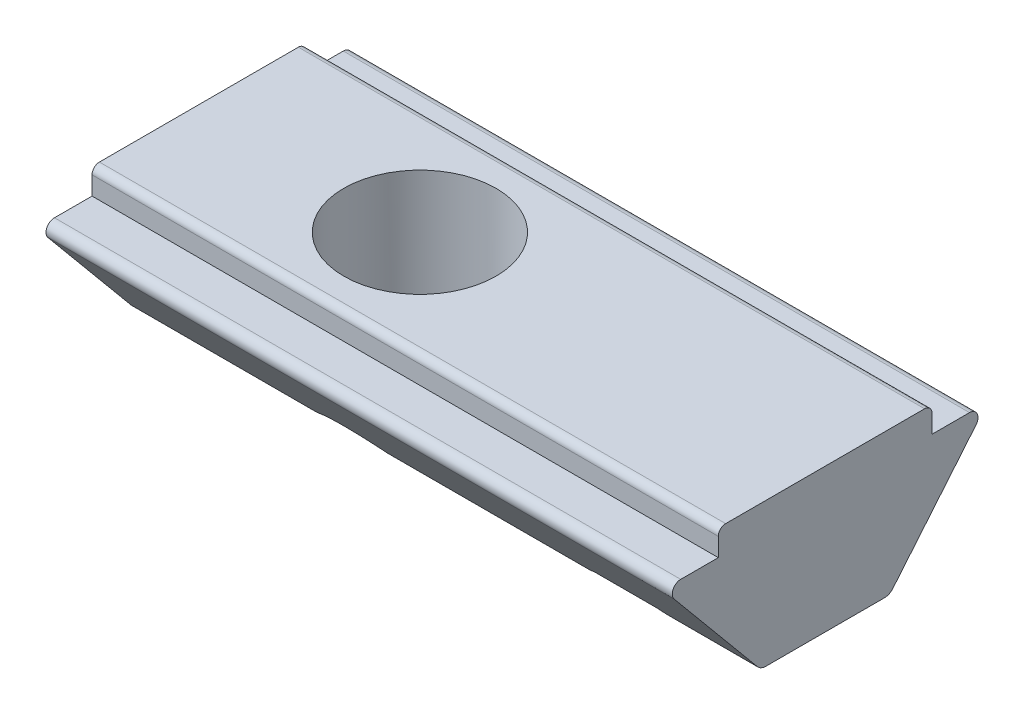
ISO-10303-21;
HEADER;
FILE_DESCRIPTION(('STEP AP214'),'2;1');
FILE_NAME('part.step','',(''),(''),'','','');
FILE_SCHEMA(('AUTOMOTIVE_DESIGN { 1 0 10303 214 1 1 1 1 }'));
ENDSEC;
DATA;
#1=APPLICATION_CONTEXT('core data for automotive mechanical design processes');
#2=APPLICATION_PROTOCOL_DEFINITION('international standard','automotive_design',2000,#1);
#3=PRODUCT_CONTEXT('',#1,'mechanical');
#4=PRODUCT('Part','Part','',(#3));
#5=PRODUCT_RELATED_PRODUCT_CATEGORY('part','',(#4));
#6=PRODUCT_DEFINITION_FORMATION('','',#4);
#7=PRODUCT_DEFINITION_CONTEXT('part definition',#1,'design');
#8=PRODUCT_DEFINITION('design','',#6,#7);
#9=PRODUCT_DEFINITION_SHAPE('','',#8);
#10=(LENGTH_UNIT() NAMED_UNIT(*) SI_UNIT(.MILLI.,.METRE.));
#11=(NAMED_UNIT(*) PLANE_ANGLE_UNIT() SI_UNIT($,.RADIAN.));
#12=(NAMED_UNIT(*) SI_UNIT($,.STERADIAN.) SOLID_ANGLE_UNIT());
#13=UNCERTAINTY_MEASURE_WITH_UNIT(LENGTH_MEASURE(1.E-05),#10,'distance_accuracy_value','');
#14=(GEOMETRIC_REPRESENTATION_CONTEXT(3) GLOBAL_UNCERTAINTY_ASSIGNED_CONTEXT((#13)) GLOBAL_UNIT_ASSIGNED_CONTEXT((#10,
#11,#12)) REPRESENTATION_CONTEXT('',''));
#15=CARTESIAN_POINT('',(0.,0.,0.));
#16=DIRECTION('',(0.,0.,1.));
#17=DIRECTION('',(1.,0.,0.));
#18=AXIS2_PLACEMENT_3D('',#15,#16,#17);
#19=CARTESIAN_POINT('',(11.,-3.9,1.75));
#20=DIRECTION('',(0.,1.,0.));
#21=DIRECTION('',(0.,0.,1.));
#22=AXIS2_PLACEMENT_3D('',#19,#20,#21);
#23=PLANE('',#22);
#24=DIRECTION('',(-1.,0.,0.));
#25=VECTOR('',#24,1.);
#26=CARTESIAN_POINT('',(11.,-3.9,1.60927283533169));
#27=LINE('',#26,#25);
#28=CARTESIAN_POINT('',(6.15083694778447,-3.9,1.60927283533169));
#29=VERTEX_POINT('',#28);
#30=CARTESIAN_POINT('',(1.29720080999956,-3.9,1.60927283533169));
#31=VERTEX_POINT('',#30);
#32=EDGE_CURVE('E360',#29,#31,#27,.T.);
#33=ORIENTED_EDGE('',*,*,#32,.T.);
#34=CARTESIAN_POINT('',(0.,-3.9,0.));
#35=DIRECTION('',(0.,1.,0.));
#36=DIRECTION('',(0.,0.,1.));
#37=AXIS2_PLACEMENT_3D('',#34,#35,#36);
#38=CIRCLE('',#37,2.067);
#39=CARTESIAN_POINT('',(1.29720080999955,-3.9,-1.60927283533169));
#40=VERTEX_POINT('',#39);
#41=EDGE_CURVE('E59',#31,#40,#38,.T.);
#42=ORIENTED_EDGE('',*,*,#41,.T.);
#43=DIRECTION('',(-1.,0.,0.));
#44=VECTOR('',#43,1.);
#45=CARTESIAN_POINT('',(11.,-3.9,-1.60927283533169));
#46=LINE('',#45,#44);
#47=CARTESIAN_POINT('',(6.15083694778448,-3.9,-1.60927283533169));
#48=VERTEX_POINT('',#47);
#49=EDGE_CURVE('E66',#40,#48,#46,.F.);
#50=ORIENTED_EDGE('',*,*,#49,.T.);
#51=CARTESIAN_POINT('',(7.5,-3.9,0.));
#52=DIRECTION('',(0.,1.,0.));
#53=DIRECTION('',(0.,0.,1.));
#54=AXIS2_PLACEMENT_3D('',#51,#52,#53);
#55=CIRCLE('',#54,2.1);
#56=EDGE_CURVE('E354',#48,#29,#55,.T.);
#57=ORIENTED_EDGE('',*,*,#56,.T.);
#58=EDGE_LOOP('',(#33,#42,#50,#57));
#59=FACE_BOUND('',#58,.T.);
#60=ADVANCED_FACE('F38',(#59),#23,.F.);
#61=CARTESIAN_POINT('',(11.,-3.6,-1.60927283533169));
#62=DIRECTION('',(-1.,0.,0.));
#63=DIRECTION('',(0.,0.,1.));
#64=AXIS2_PLACEMENT_3D('',#61,#62,#63);
#65=CYLINDRICAL_SURFACE('',#64,0.3);
#66=CARTESIAN_POINT('',(-1.29720080999955,-3.9,-1.60927283533169));
#67=CARTESIAN_POINT('',(-1.27974293237476,-3.89999128934075,-1.62334724323147));
#68=CARTESIAN_POINT('',(-1.2620737162754,-3.89901135164048,-1.63711891595062));
#69=CARTESIAN_POINT('',(-1.22642965644565,-3.89528120129688,-1.66398801441038));
#70=CARTESIAN_POINT('',(-1.20845504037879,-3.89253225547317,-1.67708591540852));
#71=CARTESIAN_POINT('',(-1.1549406520226,-3.88203082036834,-1.71478116309034));
#72=CARTESIAN_POINT('',(-1.1190971994342,-3.87200825235047,-1.73835221681893));
#73=CARTESIAN_POINT('',(-1.05957824577181,-3.85065115458066,-1.77498300902969));
#74=CARTESIAN_POINT('',(-1.03585557140469,-3.84088535441787,-1.7889158503905));
#75=CARTESIAN_POINT('',(-1.00043401580829,-3.82418669508058,-1.80881374381069));
#76=CARTESIAN_POINT('',(-0.988576784850685,-3.8182329207292,-1.8153187211507));
#77=CARTESIAN_POINT('',(-0.965041137451065,-3.80558184134619,-1.82793984997824));
#78=CARTESIAN_POINT('',(-0.95336285554577,-3.79888400539671,-1.83405571886375));
#79=CARTESIAN_POINT('',(-0.941817360790472,-3.79178475893633,-1.83996441783902));
#80=B_SPLINE_CURVE_WITH_KNOTS('',3,(#66,#67,#68,#69,#70,#71,#72,#73,#74,#75,#76,#77,#78,#79),
.UNSPECIFIED.,.F.,.F.,(4,2,2,2,2,2,4),(0.,0.0672080338937752,0.134367992342279,
0.265975595194617,0.353421910220517,0.39772945333734,0.442068817235654),.UNSPECIFIED.);
#81=CARTESIAN_POINT('',(-1.29720080999955,-3.9,-1.60927283533169));
#82=VERTEX_POINT('',#81);
#83=CARTESIAN_POINT('',(-0.941817360790466,-3.79178475893633,-1.83996441783902));
#84=VERTEX_POINT('',#83);
#85=EDGE_CURVE('E342',#82,#84,#80,.T.);
#86=ORIENTED_EDGE('',*,*,#85,.F.);
#87=CARTESIAN_POINT('',(-6.,-3.9,-1.60927283533169));
#88=VERTEX_POINT('',#87);
#89=EDGE_CURVE('E366',#88,#82,#46,.F.);
#90=ORIENTED_EDGE('',*,*,#89,.F.);
#91=CARTESIAN_POINT('',(-6.,-3.6,-1.60927283533169));
#92=DIRECTION('',(-1.,0.,0.));
#93=DIRECTION('',(0.,0.,1.));
#94=AXIS2_PLACEMENT_3D('',#91,#92,#93);
#95=CIRCLE('',#94,0.3);
#96=CARTESIAN_POINT('',(-6.,-3.79178475893633,-1.83996441783902));
#97=VERTEX_POINT('',#96);
#98=EDGE_CURVE('E365',#97,#88,#95,.T.);
#99=ORIENTED_EDGE('',*,*,#98,.F.);
#100=DIRECTION('',(-1.,0.,0.));
#101=VECTOR('',#100,1.);
#102=CARTESIAN_POINT('',(11.,-3.79178475893633,-1.83996441783902));
#103=LINE('',#102,#101);
#104=EDGE_CURVE('E236',#84,#97,#103,.T.);
#105=ORIENTED_EDGE('',*,*,#104,.F.);
#106=EDGE_LOOP('',(#86,#90,#99,#105));
#107=FACE_BOUND('',#106,.T.);
#108=ADVANCED_FACE('F488',(#107),#65,.T.);
#109=CARTESIAN_POINT('',(11.,-3.6,1.60927283533169));
#110=DIRECTION('',(-1.,0.,0.));
#111=DIRECTION('',(0.,0.,1.));
#112=AXIS2_PLACEMENT_3D('',#109,#110,#111);
#113=CYLINDRICAL_SURFACE('',#112,0.3);
#114=CARTESIAN_POINT('',(-0.941817360790473,-3.79178475893633,1.83996441783901));
#115=CARTESIAN_POINT('',(-0.959536967771565,-3.80264927398413,1.83089913523369));
#116=CARTESIAN_POINT('',(-0.977543826134357,-3.81260387629664,1.82135454319004));
#117=CARTESIAN_POINT('',(-1.0138983493778,-3.83083897464804,1.80136737059737));
#118=CARTESIAN_POINT('',(-1.0322459078334,-3.83911998417495,1.79092506688812));
#119=CARTESIAN_POINT('',(-1.06868991680062,-3.85400919668802,1.76941547577826));
#120=CARTESIAN_POINT('',(-1.08678401745704,-3.8606476347989,1.75836493608639));
#121=CARTESIAN_POINT('',(-1.12295598491964,-3.8724622644158,1.7354875396833));
#122=CARTESIAN_POINT('',(-1.14103385249653,-3.8776385294479,1.72366072204446));
#123=CARTESIAN_POINT('',(-1.18230339098004,-3.88776731923938,1.69571039796934));
#124=CARTESIAN_POINT('',(-1.2054537720449,-3.89221726967314,1.67933737075325));
#125=CARTESIAN_POINT('',(-1.251596475979,-3.8983382028379,1.64524687968425));
#126=CARTESIAN_POINT('',(-1.2745826924218,-3.89997177931288,1.62751453832146));
#127=CARTESIAN_POINT('',(-1.29720080999956,-3.9,1.60927283533169));
#128=B_SPLINE_CURVE_WITH_KNOTS('',3,(#114,#115,#116,#117,#118,#119,#120,#121,#122,#123,#124,
#125,#126,#127),.UNSPECIFIED.,.F.,.F.,(4,2,2,2,2,2,4),(0.,0.0679738673511678,0.135926847343073,
0.202516136311645,0.269102076209518,0.355046711932197,0.442124289355897),.UNSPECIFIED.);
#129=CARTESIAN_POINT('',(-0.94181736079047,-3.79178475893633,1.83996441783902));
#130=VERTEX_POINT('',#129);
#131=CARTESIAN_POINT('',(-1.29720080999956,-3.9,1.60927283533169));
#132=VERTEX_POINT('',#131);
#133=EDGE_CURVE('E11',#130,#132,#128,.T.);
#134=ORIENTED_EDGE('',*,*,#133,.F.);
#135=DIRECTION('',(-1.,0.,0.));
#136=VECTOR('',#135,1.);
#137=CARTESIAN_POINT('',(11.,-3.79178475893633,1.83996441783902));
#138=LINE('',#137,#136);
#139=CARTESIAN_POINT('',(-6.,-3.79178475893633,1.83996441783902));
#140=VERTEX_POINT('',#139);
#141=EDGE_CURVE('E220',#140,#130,#138,.F.);
#142=ORIENTED_EDGE('',*,*,#141,.F.);
#143=CARTESIAN_POINT('',(-6.,-3.6,1.60927283533169));
#144=DIRECTION('',(-1.,0.,0.));
#145=DIRECTION('',(0.,0.,1.));
#146=AXIS2_PLACEMENT_3D('',#143,#144,#145);
#147=CIRCLE('',#146,0.3);
#148=CARTESIAN_POINT('',(-6.,-3.9,1.60927283533169));
#149=VERTEX_POINT('',#148);
#150=EDGE_CURVE('E229',#149,#140,#147,.T.);
#151=ORIENTED_EDGE('',*,*,#150,.F.);
#152=EDGE_CURVE('E363',#132,#149,#27,.T.);
#153=ORIENTED_EDGE('',*,*,#152,.F.);
#154=EDGE_LOOP('',(#134,#142,#151,#153));
#155=FACE_BOUND('',#154,.T.);
#156=ADVANCED_FACE('F308',(#155),#113,.T.);
#157=CARTESIAN_POINT('',(7.5,-3.7,0.));
#158=DIRECTION('',(0.,-1.,0.));
#159=DIRECTION('',(0.,0.,-1.));
#160=AXIS2_PLACEMENT_3D('',#157,#158,#159);
#161=PLANE('',#160);
#162=DIRECTION('',(-1.,0.,0.));
#163=VECTOR('',#162,1.);
#164=CARTESIAN_POINT('',(11.,-3.7,1.9162694033756));
#165=LINE('',#164,#163);
#166=CARTESIAN_POINT('',(8.35901779590794,-3.7,1.9162694033756));
#167=VERTEX_POINT('',#166);
#168=CARTESIAN_POINT('',(6.64098220409206,-3.7,1.9162694033756));
#169=VERTEX_POINT('',#168);
#170=EDGE_CURVE('E443',#167,#169,#165,.T.);
#171=ORIENTED_EDGE('',*,*,#170,.T.);
#172=CARTESIAN_POINT('',(7.5,-3.7,0.));
#173=DIRECTION('',(0.,1.,0.));
#174=DIRECTION('',(0.,0.,1.));
#175=AXIS2_PLACEMENT_3D('',#172,#173,#174);
#176=CIRCLE('',#175,2.1);
#177=CARTESIAN_POINT('',(6.64098220409206,-3.7,-1.9162694033756));
#178=VERTEX_POINT('',#177);
#179=EDGE_CURVE('E351',#178,#169,#176,.T.);
#180=ORIENTED_EDGE('',*,*,#179,.F.);
#181=DIRECTION('',(1.,0.,0.));
#182=VECTOR('',#181,1.);
#183=CARTESIAN_POINT('',(11.,-3.7,-1.9162694033756));
#184=LINE('',#183,#182);
#185=CARTESIAN_POINT('',(8.35901779590794,-3.7,-1.9162694033756));
#186=VERTEX_POINT('',#185);
#187=EDGE_CURVE('E211',#178,#186,#184,.T.);
#188=ORIENTED_EDGE('',*,*,#187,.T.);
#189=EDGE_CURVE('E352',#167,#186,#176,.T.);
#190=ORIENTED_EDGE('',*,*,#189,.F.);
#191=EDGE_LOOP('',(#171,#180,#188,#190));
#192=FACE_BOUND('',#191,.T.);
#193=CARTESIAN_POINT('',(7.5,-3.7,0.));
#194=DIRECTION('',(0.,1.,0.));
#195=DIRECTION('',(0.,0.,1.));
#196=AXIS2_PLACEMENT_3D('',#193,#194,#195);
#197=CIRCLE('',#196,1.73205080756888);
#198=CARTESIAN_POINT('',(7.5,-3.7,1.73205080756888));
#199=VERTEX_POINT('',#198);
#200=EDGE_CURVE('E348',#199,#199,#197,.T.);
#201=ORIENTED_EDGE('',*,*,#200,.T.);
#202=EDGE_LOOP('',(#201));
#203=FACE_BOUND('',#202,.T.);
#204=ADVANCED_FACE('F283',(#192,#203),#161,.T.);
#205=CARTESIAN_POINT('',(11.,-1.07703498185118,4.09686354658895));
#206=DIRECTION('',(0.,0.639282529787763,-0.768971941691085));
#207=DIRECTION('',(0.,0.768971941691085,0.639282529787763));
#208=AXIS2_PLACEMENT_3D('',#205,#206,#207);
#209=PLANE('',#208);
#210=ORIENTED_EDGE('',*,*,#141,.T.);
#211=CARTESIAN_POINT('',(0.,-6.00501747702407,0.));
#212=DIRECTION('',(0.,0.639282529787763,-0.768971941691085));
#213=DIRECTION('',(0.,0.768971941691085,0.639282529787763));
#214=AXIS2_PLACEMENT_3D('',#211,#212,#213);
#215=ELLIPSE('',#214,3.23331219560501,2.067);
#216=CARTESIAN_POINT('',(0.941817360790473,-3.79178475893633,1.83996441783901));
#217=VERTEX_POINT('',#216);
#218=EDGE_CURVE('E205',#130,#217,#215,.T.);
#219=ORIENTED_EDGE('',*,*,#218,.T.);
#220=CARTESIAN_POINT('',(6.48780884162805,-3.79178475893633,1.83996441783901));
#221=VERTEX_POINT('',#220);
#222=EDGE_CURVE('E216',#217,#221,#138,.F.);
#223=ORIENTED_EDGE('',*,*,#222,.T.);
#224=CARTESIAN_POINT('',(7.5,-6.00501747702407,0.));
#225=DIRECTION('',(0.,0.639282529787763,-0.768971941691085));
#226=DIRECTION('',(0.,0.768971941691085,0.639282529787763));
#227=AXIS2_PLACEMENT_3D('',#224,#225,#226);
#228=ELLIPSE('',#227,3.28493256447534,2.1);
#229=EDGE_CURVE('E298',#169,#221,#228,.F.);
#230=ORIENTED_EDGE('',*,*,#229,.F.);
#231=ORIENTED_EDGE('',*,*,#170,.F.);
#232=CARTESIAN_POINT('',(8.51219115837194,-3.79178475893633,1.83996441783901));
#233=VERTEX_POINT('',#232);
#234=EDGE_CURVE('E464',#233,#167,#228,.F.);
#235=ORIENTED_EDGE('',*,*,#234,.F.);
#236=CARTESIAN_POINT('',(11.,-3.79178475893633,1.83996441783902));
#237=VERTEX_POINT('',#236);
#238=EDGE_CURVE('E226',#233,#237,#138,.F.);
#239=ORIENTED_EDGE('',*,*,#238,.T.);
#240=DIRECTION('',(0.,-0.768971941691085,-0.639282529787763));
#241=VECTOR('',#240,1.);
#242=CARTESIAN_POINT('',(11.,-1.07703498185118,4.09686354658895));
#243=LINE('',#242,#241);
#244=CARTESIAN_POINT('',(11.,-1.07703498185118,4.09686354658895));
#245=VERTEX_POINT('',#244);
#246=EDGE_CURVE('E451',#245,#237,#243,.T.);
#247=ORIENTED_EDGE('',*,*,#246,.F.);
#248=DIRECTION('',(-1.,0.,0.));
#249=VECTOR('',#248,1.);
#250=CARTESIAN_POINT('',(11.,-1.07703498185118,4.09686354658895));
#251=LINE('',#250,#249);
#252=CARTESIAN_POINT('',(-6.,-1.07703498185118,4.09686354658895));
#253=VERTEX_POINT('',#252);
#254=EDGE_CURVE('E386',#245,#253,#251,.T.);
#255=ORIENTED_EDGE('',*,*,#254,.T.);
#256=DIRECTION('',(0.,-0.768971941691085,-0.639282529787763));
#257=VECTOR('',#256,1.);
#258=CARTESIAN_POINT('',(-6.,-1.07703498185118,4.09686354658895));
#259=LINE('',#258,#257);
#260=EDGE_CURVE('E379',#253,#140,#259,.T.);
#261=ORIENTED_EDGE('',*,*,#260,.T.);
#262=EDGE_LOOP('',(#210,#219,#223,#230,#231,#235,#239,#247,#255,#261));
#263=FACE_BOUND('',#262,.T.);
#264=ADVANCED_FACE('F214',(#263),#209,.F.);
#265=ORIENTED_EDGE('',*,*,#89,.T.);
#266=EDGE_CURVE('E341',#82,#132,#38,.T.);
#267=ORIENTED_EDGE('',*,*,#266,.T.);
#268=ORIENTED_EDGE('',*,*,#152,.T.);
#269=DIRECTION('',(0.,0.,-1.));
#270=VECTOR('',#269,1.);
#271=CARTESIAN_POINT('',(-6.,-3.9,1.75));
#272=LINE('',#271,#270);
#273=EDGE_CURVE('E380',#149,#88,#272,.T.);
#274=ORIENTED_EDGE('',*,*,#273,.T.);
#275=EDGE_LOOP('',(#265,#267,#268,#274));
#276=FACE_BOUND('',#275,.T.);
#277=ADVANCED_FACE('F393',(#276),#23,.F.);
#278=CARTESIAN_POINT('',(8.84916305221553,-3.9,1.60927283533169));
#279=VERTEX_POINT('',#278);
#280=CARTESIAN_POINT('',(8.84916305221552,-3.9,-1.60927283533169));
#281=VERTEX_POINT('',#280);
#282=EDGE_CURVE('E355',#279,#281,#55,.T.);
#283=ORIENTED_EDGE('',*,*,#282,.T.);
#284=CARTESIAN_POINT('',(11.,-3.9,-1.60927283533169));
#285=VERTEX_POINT('',#284);
#286=EDGE_CURVE('E400',#281,#285,#46,.F.);
#287=ORIENTED_EDGE('',*,*,#286,.T.);
#288=DIRECTION('',(0.,0.,-1.));
#289=VECTOR('',#288,1.);
#290=CARTESIAN_POINT('',(11.,-3.9,1.75));
#291=LINE('',#290,#289);
#292=CARTESIAN_POINT('',(11.,-3.9,1.60927283533169));
#293=VERTEX_POINT('',#292);
#294=EDGE_CURVE('E449',#293,#285,#291,.T.);
#295=ORIENTED_EDGE('',*,*,#294,.F.);
#296=EDGE_CURVE('E362',#293,#279,#27,.T.);
#297=ORIENTED_EDGE('',*,*,#296,.T.);
#298=EDGE_LOOP('',(#283,#287,#295,#297));
#299=FACE_BOUND('',#298,.T.);
#300=ADVANCED_FACE('F477',(#299),#23,.F.);
#301=CARTESIAN_POINT('',(11.,-3.9,-1.75));
#302=DIRECTION('',(0.,0.639282529787763,0.768971941691085));
#303=DIRECTION('',(0.,-0.768971941691086,0.639282529787763));
#304=AXIS2_PLACEMENT_3D('',#301,#302,#303);
#305=PLANE('',#304);
#306=CARTESIAN_POINT('',(6.48780884162806,-3.79178475893633,-1.83996441783902));
#307=VERTEX_POINT('',#306);
#308=CARTESIAN_POINT('',(0.941817360790472,-3.79178475893633,-1.83996441783902));
#309=VERTEX_POINT('',#308);
#310=EDGE_CURVE('E241',#307,#309,#103,.T.);
#311=ORIENTED_EDGE('',*,*,#310,.T.);
#312=CARTESIAN_POINT('',(0.,-6.00501747702407,0.));
#313=DIRECTION('',(0.,0.639282529787763,0.768971941691085));
#314=DIRECTION('',(0.,0.768971941691086,-0.639282529787763));
#315=AXIS2_PLACEMENT_3D('',#312,#313,#314);
#316=ELLIPSE('',#315,3.23331219560501,2.067);
#317=EDGE_CURVE('E339',#309,#84,#316,.T.);
#318=ORIENTED_EDGE('',*,*,#317,.T.);
#319=ORIENTED_EDGE('',*,*,#104,.T.);
#320=DIRECTION('',(0.,0.768971941691086,-0.639282529787763));
#321=VECTOR('',#320,1.);
#322=CARTESIAN_POINT('',(-6.,-3.9,-1.75));
#323=LINE('',#322,#321);
#324=CARTESIAN_POINT('',(-6.,-1.07703498185118,-4.09686354658895));
#325=VERTEX_POINT('',#324);
#326=EDGE_CURVE('E429',#97,#325,#323,.T.);
#327=ORIENTED_EDGE('',*,*,#326,.T.);
#328=DIRECTION('',(-1.,0.,0.));
#329=VECTOR('',#328,1.);
#330=CARTESIAN_POINT('',(11.,-1.07703498185118,-4.09686354658895));
#331=LINE('',#330,#329);
#332=CARTESIAN_POINT('',(11.,-1.07703498185118,-4.09686354658895));
#333=VERTEX_POINT('',#332);
#334=EDGE_CURVE('E414',#333,#325,#331,.T.);
#335=ORIENTED_EDGE('',*,*,#334,.F.);
#336=DIRECTION('',(0.,0.768971941691086,-0.639282529787763));
#337=VECTOR('',#336,1.);
#338=CARTESIAN_POINT('',(11.,-3.9,-1.75));
#339=LINE('',#338,#337);
#340=CARTESIAN_POINT('',(11.,-3.79178475893633,-1.83996441783902));
#341=VERTEX_POINT('',#340);
#342=EDGE_CURVE('E447',#341,#333,#339,.T.);
#343=ORIENTED_EDGE('',*,*,#342,.F.);
#344=CARTESIAN_POINT('',(8.51219115837194,-3.79178475893633,-1.83996441783902));
#345=VERTEX_POINT('',#344);
#346=EDGE_CURVE('E237',#341,#345,#103,.T.);
#347=ORIENTED_EDGE('',*,*,#346,.T.);
#348=CARTESIAN_POINT('',(7.5,-6.00501747702407,0.));
#349=DIRECTION('',(0.,0.639282529787763,0.768971941691085));
#350=DIRECTION('',(0.,0.768971941691086,-0.639282529787763));
#351=AXIS2_PLACEMENT_3D('',#348,#349,#350);
#352=ELLIPSE('',#351,3.28493256447534,2.1);
#353=EDGE_CURVE('E299',#186,#345,#352,.F.);
#354=ORIENTED_EDGE('',*,*,#353,.F.);
#355=ORIENTED_EDGE('',*,*,#187,.F.);
#356=EDGE_CURVE('E300',#307,#178,#352,.F.);
#357=ORIENTED_EDGE('',*,*,#356,.F.);
#358=EDGE_LOOP('',(#311,#318,#319,#327,#335,#343,#347,#354,#355,#357));
#359=FACE_BOUND('',#358,.T.);
#360=ADVANCED_FACE('F306',(#359),#305,.F.);
#361=ORIENTED_EDGE('',*,*,#238,.F.);
#362=CARTESIAN_POINT('',(8.51219115837194,-3.79178475893633,1.83996441783901));
#363=CARTESIAN_POINT('',(8.52800442365884,-3.80221006430888,1.83126951991368));
#364=CARTESIAN_POINT('',(8.54411215779907,-3.81178506566316,1.82213898292123));
#365=CARTESIAN_POINT('',(8.57669033559653,-3.82937090988923,1.80307780916895));
#366=CARTESIAN_POINT('',(8.5931605393776,-3.83738275453271,1.79314769063603));
#367=CARTESIAN_POINT('',(8.62592345109863,-3.85184396854946,1.77275560922012));
#368=CARTESIAN_POINT('',(8.64221300683949,-3.8583216741598,1.76230847417787));
#369=CARTESIAN_POINT('',(8.67482269246242,-3.86993811339133,1.74073956556206));
#370=CARTESIAN_POINT('',(8.69114282545044,-3.87507670262788,1.72961771939983));
#371=CARTESIAN_POINT('',(8.73123818780165,-3.88605773923451,1.70143933606845));
#372=CARTESIAN_POINT('',(8.75497432804617,-3.89112861619413,1.68401481126825));
#373=CARTESIAN_POINT('',(8.80233510271543,-3.89810641303652,1.6476768027842));
#374=CARTESIAN_POINT('',(8.82595264930398,-3.8999644329173,1.62874481806492));
#375=CARTESIAN_POINT('',(8.84916305221553,-3.9,1.60927283533169));
#376=B_SPLINE_CURVE_WITH_KNOTS('',3,(#362,#363,#364,#365,#366,#367,#368,#369,#370,#371,#372,
#373,#374,#375),.UNSPECIFIED.,.F.,.F.,(4,2,2,2,2,2,4),(0.,0.0624695945832404,0.124899022160282,
0.186065188171721,0.247237946444278,0.336671790362523,0.427455223608033),.UNSPECIFIED.);
#377=EDGE_CURVE('E314',#233,#279,#376,.T.);
#378=ORIENTED_EDGE('',*,*,#377,.T.);
#379=ORIENTED_EDGE('',*,*,#296,.F.);
#380=CARTESIAN_POINT('',(11.,-3.6,1.60927283533169));
#381=DIRECTION('',(-1.,0.,0.));
#382=DIRECTION('',(0.,0.,1.));
#383=AXIS2_PLACEMENT_3D('',#380,#381,#382);
#384=CIRCLE('',#383,0.3);
#385=EDGE_CURVE('E234',#237,#293,#384,.F.);
#386=ORIENTED_EDGE('',*,*,#385,.F.);
#387=EDGE_LOOP('',(#361,#378,#379,#386));
#388=FACE_BOUND('',#387,.T.);
#389=ADVANCED_FACE('F302',(#388),#113,.T.);
#390=CARTESIAN_POINT('',(1.29720080999956,-3.9,1.60927283533169));
#391=CARTESIAN_POINT('',(1.27974293237476,-3.89999128934075,1.62334724323147));
#392=CARTESIAN_POINT('',(1.2620737162754,-3.89901135164048,1.63711891595062));
#393=CARTESIAN_POINT('',(1.22642965644565,-3.89528120129688,1.66398801441038));
#394=CARTESIAN_POINT('',(1.20845504037879,-3.89253225547317,1.67708591540852));
#395=CARTESIAN_POINT('',(1.1549406520226,-3.88203082036834,1.71478116309034));
#396=CARTESIAN_POINT('',(1.11909719943421,-3.87200825235047,1.73835221681893));
#397=CARTESIAN_POINT('',(1.05957824577181,-3.85065115458066,1.77498300902969));
#398=CARTESIAN_POINT('',(1.03585557140469,-3.84088535441787,1.7889158503905));
#399=CARTESIAN_POINT('',(1.00043401580829,-3.82418669508058,1.80881374381068));
#400=CARTESIAN_POINT('',(0.988576784850686,-3.8182329207292,1.8153187211507));
#401=CARTESIAN_POINT('',(0.965041137451066,-3.80558184134619,1.82793984997824));
#402=CARTESIAN_POINT('',(0.953362855545771,-3.79888400539671,1.83405571886374));
#403=CARTESIAN_POINT('',(0.941817360790473,-3.79178475893633,1.83996441783901));
#404=B_SPLINE_CURVE_WITH_KNOTS('',3,(#390,#391,#392,#393,#394,#395,#396,#397,#398,#399,#400,
#401,#402,#403),.UNSPECIFIED.,.F.,.F.,(4,2,2,2,2,2,4),(0.,0.067208033893775,0.134367992342279,
0.265975595194616,0.353421910220516,0.39772945333734,0.442068817235654),.UNSPECIFIED.);
#405=EDGE_CURVE('E52',#31,#217,#404,.T.);
#406=ORIENTED_EDGE('',*,*,#405,.F.);
#407=ORIENTED_EDGE('',*,*,#32,.F.);
#408=CARTESIAN_POINT('',(6.15083694778447,-3.9,1.60927283533169));
#409=CARTESIAN_POINT('',(6.16726314874561,-3.89999221448579,1.62304590694146));
#410=CARTESIAN_POINT('',(6.18388440749588,-3.89905306790869,1.63655005408616));
#411=CARTESIAN_POINT('',(6.21740653841518,-3.89546028494459,1.66295161336739));
#412=CARTESIAN_POINT('',(6.23430723127831,-3.8928077093669,1.67584939561672));
#413=CARTESIAN_POINT('',(6.28456584016906,-3.88264720849691,1.71301672945264));
#414=CARTESIAN_POINT('',(6.31819219915266,-3.87292210907077,1.73635443388923));
#415=CARTESIAN_POINT('',(6.37461878820967,-3.85183731426433,1.77320899292095));
#416=CARTESIAN_POINT('',(6.39748587759531,-3.84196257495056,1.78750052544176));
#417=CARTESIAN_POINT('',(6.4315674646954,-3.82497352043113,1.80793544123543));
#418=CARTESIAN_POINT('',(6.44297224110469,-3.81889620056429,1.81462415998937));
#419=CARTESIAN_POINT('',(6.46557219007116,-3.80595034421082,1.82760230285763));
#420=CARTESIAN_POINT('',(6.47676718075581,-3.79908115504866,1.83389139086946));
#421=CARTESIAN_POINT('',(6.48780884162805,-3.79178475893633,1.83996441783902));
#422=B_SPLINE_CURVE_WITH_KNOTS('',3,(#408,#409,#410,#411,#412,#413,#414,#415,#416,#417,#418,
#419,#420,#421),.UNSPECIFIED.,.F.,.F.,(4,2,2,2,2,2,4),(0.,0.0642474402939419,0.128455142119495,
0.254120267545124,0.340118608935548,0.383746420830759,0.427410452321446),.UNSPECIFIED.);
#423=EDGE_CURVE('E225',#29,#221,#422,.T.);
#424=ORIENTED_EDGE('',*,*,#423,.T.);
#425=ORIENTED_EDGE('',*,*,#222,.F.);
#426=EDGE_LOOP('',(#406,#407,#424,#425));
#427=FACE_BOUND('',#426,.T.);
#428=ADVANCED_FACE('F224',(#427),#113,.T.);
#429=ORIENTED_EDGE('',*,*,#286,.F.);
#430=CARTESIAN_POINT('',(8.84916305221552,-3.9,-1.60927283533169));
#431=CARTESIAN_POINT('',(8.83273685125439,-3.89999221448579,-1.62304590694146));
#432=CARTESIAN_POINT('',(8.81611559250412,-3.89905306790869,-1.63655005408616));
#433=CARTESIAN_POINT('',(8.78259346158482,-3.89546028494459,-1.66295161336739));
#434=CARTESIAN_POINT('',(8.76569276872169,-3.8928077093669,-1.67584939561672));
#435=CARTESIAN_POINT('',(8.71543415983094,-3.88264720849691,-1.71301672945264));
#436=CARTESIAN_POINT('',(8.68180780084734,-3.87292210907077,-1.73635443388923));
#437=CARTESIAN_POINT('',(8.62538121179033,-3.85183731426433,-1.77320899292095));
#438=CARTESIAN_POINT('',(8.60251412240469,-3.84196257495057,-1.78750052544176));
#439=CARTESIAN_POINT('',(8.5684325353046,-3.82497352043113,-1.80793544123543));
#440=CARTESIAN_POINT('',(8.55702775889531,-3.81889620056429,-1.81462415998937));
#441=CARTESIAN_POINT('',(8.53442780992884,-3.80595034421082,-1.82760230285763));
#442=CARTESIAN_POINT('',(8.52323281924419,-3.79908115504866,-1.83389139086946));
#443=CARTESIAN_POINT('',(8.51219115837194,-3.79178475893633,-1.83996441783902));
#444=B_SPLINE_CURVE_WITH_KNOTS('',3,(#430,#431,#432,#433,#434,#435,#436,#437,#438,#439,#440,
#441,#442,#443),.UNSPECIFIED.,.F.,.F.,(4,2,2,2,2,2,4),(0.,0.0642474402939427,0.128455142119496,
0.254120267545124,0.340118608935546,0.383746420830758,0.427410452321446),.UNSPECIFIED.);
#445=EDGE_CURVE('E268',#281,#345,#444,.T.);
#446=ORIENTED_EDGE('',*,*,#445,.T.);
#447=ORIENTED_EDGE('',*,*,#346,.F.);
#448=CARTESIAN_POINT('',(11.,-3.6,-1.60927283533169));
#449=DIRECTION('',(-1.,0.,0.));
#450=DIRECTION('',(0.,0.,1.));
#451=AXIS2_PLACEMENT_3D('',#448,#449,#450);
#452=CIRCLE('',#451,0.3);
#453=EDGE_CURVE('E228',#285,#341,#452,.F.);
#454=ORIENTED_EDGE('',*,*,#453,.F.);
#455=EDGE_LOOP('',(#429,#446,#447,#454));
#456=FACE_BOUND('',#455,.T.);
#457=ADVANCED_FACE('F274',(#456),#65,.T.);
#458=CARTESIAN_POINT('',(0.941817360790472,-3.79178475893633,-1.83996441783902));
#459=CARTESIAN_POINT('',(0.959536967771564,-3.80264927398413,-1.83089913523369));
#460=CARTESIAN_POINT('',(0.977543826134355,-3.81260387629664,-1.82135454319004));
#461=CARTESIAN_POINT('',(1.0138983493778,-3.83083897464804,-1.80136737059737));
#462=CARTESIAN_POINT('',(1.0322459078334,-3.83911998417495,-1.79092506688812));
#463=CARTESIAN_POINT('',(1.06868991680062,-3.85400919668802,-1.76941547577826));
#464=CARTESIAN_POINT('',(1.08678401745704,-3.8606476347989,-1.7583649360864));
#465=CARTESIAN_POINT('',(1.12295598491964,-3.8724622644158,-1.7354875396833));
#466=CARTESIAN_POINT('',(1.14103385249653,-3.8776385294479,-1.72366072204446));
#467=CARTESIAN_POINT('',(1.18230339098004,-3.88776731923938,-1.69571039796934));
#468=CARTESIAN_POINT('',(1.2054537720449,-3.89221726967314,-1.67933737075325));
#469=CARTESIAN_POINT('',(1.251596475979,-3.8983382028379,-1.64524687968425));
#470=CARTESIAN_POINT('',(1.2745826924218,-3.89997177931288,-1.62751453832147));
#471=CARTESIAN_POINT('',(1.29720080999955,-3.9,-1.60927283533169));
#472=B_SPLINE_CURVE_WITH_KNOTS('',3,(#458,#459,#460,#461,#462,#463,#464,#465,#466,#467,#468,
#469,#470,#471),.UNSPECIFIED.,.F.,.F.,(4,2,2,2,2,2,4),(0.,0.0679738673511678,0.135926847343074,
0.202516136311646,0.269102076209518,0.355046711932198,0.442124289355896),.UNSPECIFIED.);
#473=EDGE_CURVE('E332',#309,#40,#472,.T.);
#474=ORIENTED_EDGE('',*,*,#473,.F.);
#475=ORIENTED_EDGE('',*,*,#310,.F.);
#476=CARTESIAN_POINT('',(6.48780884162806,-3.79178475893633,-1.83996441783902));
#477=CARTESIAN_POINT('',(6.47199557634116,-3.80221006430888,-1.83126951991368));
#478=CARTESIAN_POINT('',(6.45588784220094,-3.81178506566316,-1.82213898292123));
#479=CARTESIAN_POINT('',(6.42330966440348,-3.82937090988923,-1.80307780916895));
#480=CARTESIAN_POINT('',(6.4068394606224,-3.83738275453271,-1.79314769063603));
#481=CARTESIAN_POINT('',(6.37407654890137,-3.85184396854946,-1.77275560922013));
#482=CARTESIAN_POINT('',(6.35778699316051,-3.8583216741598,-1.76230847417787));
#483=CARTESIAN_POINT('',(6.32517730753758,-3.86993811339133,-1.74073956556206));
#484=CARTESIAN_POINT('',(6.30885717454956,-3.87507670262788,-1.72961771939983));
#485=CARTESIAN_POINT('',(6.26876181219835,-3.88605773923451,-1.70143933606846));
#486=CARTESIAN_POINT('',(6.24502567195383,-3.89112861619413,-1.68401481126825));
#487=CARTESIAN_POINT('',(6.19766489728457,-3.89810641303652,-1.6476768027842));
#488=CARTESIAN_POINT('',(6.17404735069602,-3.8999644329173,-1.62874481806492));
#489=CARTESIAN_POINT('',(6.15083694778448,-3.9,-1.60927283533169));
#490=B_SPLINE_CURVE_WITH_KNOTS('',3,(#476,#477,#478,#479,#480,#481,#482,#483,#484,#485,#486,
#487,#488,#489),.UNSPECIFIED.,.F.,.F.,(4,2,2,2,2,2,4),(0.,0.062469594583239,0.124899022160283,
0.186065188171722,0.247237946444279,0.336671790362524,0.427455223608031),.UNSPECIFIED.);
#491=EDGE_CURVE('E259',#307,#48,#490,.T.);
#492=ORIENTED_EDGE('',*,*,#491,.T.);
#493=ORIENTED_EDGE('',*,*,#49,.F.);
#494=EDGE_LOOP('',(#474,#475,#492,#493));
#495=FACE_BOUND('',#494,.T.);
#496=ADVANCED_FACE('F397',(#495),#65,.T.);
#497=CARTESIAN_POINT('',(11.,-0.699999999999999,-2.9));
#498=DIRECTION('',(0.,0.,1.));
#499=DIRECTION('',(0.,-1.,0.));
#500=AXIS2_PLACEMENT_3D('',#497,#498,#499);
#501=PLANE('',#500);
#502=DIRECTION('',(0.,1.,0.));
#503=VECTOR('',#502,1.);
#504=CARTESIAN_POINT('',(-6.,-0.699999999999999,-2.9));
#505=LINE('',#504,#503);
#506=CARTESIAN_POINT('',(-6.,-0.699999999999999,-2.9));
#507=VERTEX_POINT('',#506);
#508=CARTESIAN_POINT('',(-6.,-0.2,-2.9));
#509=VERTEX_POINT('',#508);
#510=EDGE_CURVE('E440',#507,#509,#505,.T.);
#511=ORIENTED_EDGE('',*,*,#510,.T.);
#512=DIRECTION('',(-1.,0.,0.));
#513=VECTOR('',#512,1.);
#514=CARTESIAN_POINT('',(11.,-0.2,-2.9));
#515=LINE('',#514,#513);
#516=CARTESIAN_POINT('',(11.,-0.2,-2.9));
#517=VERTEX_POINT('',#516);
#518=EDGE_CURVE('E257',#509,#517,#515,.F.);
#519=ORIENTED_EDGE('',*,*,#518,.T.);
#520=DIRECTION('',(0.,1.,0.));
#521=VECTOR('',#520,1.);
#522=CARTESIAN_POINT('',(11.,-0.699999999999999,-2.9));
#523=LINE('',#522,#521);
#524=CARTESIAN_POINT('',(11.,-0.699999999999999,-2.9));
#525=VERTEX_POINT('',#524);
#526=EDGE_CURVE('E426',#525,#517,#523,.T.);
#527=ORIENTED_EDGE('',*,*,#526,.F.);
#528=DIRECTION('',(-1.,0.,0.));
#529=VECTOR('',#528,1.);
#530=CARTESIAN_POINT('',(11.,-0.699999999999999,-2.9));
#531=LINE('',#530,#529);
#532=EDGE_CURVE('E420',#525,#507,#531,.T.);
#533=ORIENTED_EDGE('',*,*,#532,.T.);
#534=EDGE_LOOP('',(#511,#519,#527,#533));
#535=FACE_BOUND('',#534,.T.);
#536=ADVANCED_FACE('F309',(#535),#501,.F.);
#537=CARTESIAN_POINT('',(11.,0.,-2.9));
#538=DIRECTION('',(0.,-1.,0.));
#539=DIRECTION('',(0.,0.,-1.));
#540=AXIS2_PLACEMENT_3D('',#537,#538,#539);
#541=PLANE('',#540);
#542=CARTESIAN_POINT('',(0.,0.,0.));
#543=DIRECTION('',(0.,1.,0.));
#544=DIRECTION('',(0.,0.,1.));
#545=AXIS2_PLACEMENT_3D('',#542,#543,#544);
#546=CIRCLE('',#545,2.067);
#547=CARTESIAN_POINT('',(0.,0.,2.067));
#548=VERTEX_POINT('',#547);
#549=EDGE_CURVE('E221',#548,#548,#546,.T.);
#550=ORIENTED_EDGE('',*,*,#549,.F.);
#551=EDGE_LOOP('',(#550));
#552=FACE_BOUND('',#551,.T.);
#553=DIRECTION('',(0.,0.,1.));
#554=VECTOR('',#553,1.);
#555=CARTESIAN_POINT('',(-6.,0.,-2.9));
#556=LINE('',#555,#554);
#557=CARTESIAN_POINT('',(-6.,0.,-2.7));
#558=VERTEX_POINT('',#557);
#559=CARTESIAN_POINT('',(-6.,0.,2.7));
#560=VERTEX_POINT('',#559);
#561=EDGE_CURVE('E437',#558,#560,#556,.T.);
#562=ORIENTED_EDGE('',*,*,#561,.T.);
#563=DIRECTION('',(-1.,0.,0.));
#564=VECTOR('',#563,1.);
#565=CARTESIAN_POINT('',(11.,0.,2.7));
#566=LINE('',#565,#564);
#567=CARTESIAN_POINT('',(11.,0.,2.7));
#568=VERTEX_POINT('',#567);
#569=EDGE_CURVE('E251',#560,#568,#566,.F.);
#570=ORIENTED_EDGE('',*,*,#569,.T.);
#571=DIRECTION('',(0.,0.,1.));
#572=VECTOR('',#571,1.);
#573=CARTESIAN_POINT('',(11.,0.,-2.9));
#574=LINE('',#573,#572);
#575=CARTESIAN_POINT('',(11.,0.,-2.7));
#576=VERTEX_POINT('',#575);
#577=EDGE_CURVE('E460',#576,#568,#574,.T.);
#578=ORIENTED_EDGE('',*,*,#577,.F.);
#579=DIRECTION('',(-1.,0.,0.));
#580=VECTOR('',#579,1.);
#581=CARTESIAN_POINT('',(11.,0.,-2.7));
#582=LINE('',#581,#580);
#583=EDGE_CURVE('E248',#576,#558,#582,.T.);
#584=ORIENTED_EDGE('',*,*,#583,.T.);
#585=EDGE_LOOP('',(#562,#570,#578,#584));
#586=FACE_BOUND('',#585,.T.);
#587=ADVANCED_FACE('F527',(#552,#586),#541,.F.);
#588=CARTESIAN_POINT('',(11.,0.,2.9));
#589=DIRECTION('',(0.,0.,-1.));
#590=DIRECTION('',(0.,1.,0.));
#591=AXIS2_PLACEMENT_3D('',#588,#589,#590);
#592=PLANE('',#591);
#593=DIRECTION('',(0.,-1.,0.));
#594=VECTOR('',#593,1.);
#595=CARTESIAN_POINT('',(11.,0.,2.9));
#596=LINE('',#595,#594);
#597=CARTESIAN_POINT('',(11.,-0.2,2.9));
#598=VERTEX_POINT('',#597);
#599=CARTESIAN_POINT('',(11.,-0.699999999999999,2.9));
#600=VERTEX_POINT('',#599);
#601=EDGE_CURVE('E458',#598,#600,#596,.T.);
#602=ORIENTED_EDGE('',*,*,#601,.F.);
#603=DIRECTION('',(-1.,0.,0.));
#604=VECTOR('',#603,1.);
#605=CARTESIAN_POINT('',(11.,-0.2,2.9));
#606=LINE('',#605,#604);
#607=CARTESIAN_POINT('',(-6.,-0.2,2.9));
#608=VERTEX_POINT('',#607);
#609=EDGE_CURVE('E240',#598,#608,#606,.T.);
#610=ORIENTED_EDGE('',*,*,#609,.T.);
#611=DIRECTION('',(0.,-1.,0.));
#612=VECTOR('',#611,1.);
#613=CARTESIAN_POINT('',(-6.,0.,2.9));
#614=LINE('',#613,#612);
#615=CARTESIAN_POINT('',(-6.,-0.699999999999999,2.9));
#616=VERTEX_POINT('',#615);
#617=EDGE_CURVE('E435',#608,#616,#614,.T.);
#618=ORIENTED_EDGE('',*,*,#617,.T.);
#619=DIRECTION('',(-1.,0.,0.));
#620=VECTOR('',#619,1.);
#621=CARTESIAN_POINT('',(11.,-0.699999999999999,2.9));
#622=LINE('',#621,#620);
#623=EDGE_CURVE('E401',#600,#616,#622,.T.);
#624=ORIENTED_EDGE('',*,*,#623,.F.);
#625=EDGE_LOOP('',(#602,#610,#618,#624));
#626=FACE_BOUND('',#625,.T.);
#627=ADVANCED_FACE('F535',(#626),#592,.F.);
#628=CARTESIAN_POINT('',(11.,-0.699999999999999,2.9));
#629=DIRECTION('',(0.,-1.,0.));
#630=DIRECTION('',(0.,0.,-1.));
#631=AXIS2_PLACEMENT_3D('',#628,#629,#630);
#632=PLANE('',#631);
#633=DIRECTION('',(0.,0.,1.));
#634=VECTOR('',#633,1.);
#635=CARTESIAN_POINT('',(-6.,-0.699999999999999,2.9));
#636=LINE('',#635,#634);
#637=CARTESIAN_POINT('',(-6.,-0.699999999999999,3.92));
#638=VERTEX_POINT('',#637);
#639=EDGE_CURVE('E433',#616,#638,#636,.T.);
#640=ORIENTED_EDGE('',*,*,#639,.T.);
#641=DIRECTION('',(-1.,0.,0.));
#642=VECTOR('',#641,1.);
#643=CARTESIAN_POINT('',(11.,-0.699999999999999,3.92));
#644=LINE('',#643,#642);
#645=CARTESIAN_POINT('',(11.,-0.699999999999999,3.92));
#646=VERTEX_POINT('',#645);
#647=EDGE_CURVE('E405',#646,#638,#644,.T.);
#648=ORIENTED_EDGE('',*,*,#647,.F.);
#649=DIRECTION('',(0.,0.,1.));
#650=VECTOR('',#649,1.);
#651=CARTESIAN_POINT('',(11.,-0.699999999999999,2.9));
#652=LINE('',#651,#650);
#653=EDGE_CURVE('E456',#600,#646,#652,.T.);
#654=ORIENTED_EDGE('',*,*,#653,.F.);
#655=ORIENTED_EDGE('',*,*,#623,.T.);
#656=EDGE_LOOP('',(#640,#648,#654,#655));
#657=FACE_BOUND('',#656,.T.);
#658=ADVANCED_FACE('F537',(#657),#632,.F.);
#659=CARTESIAN_POINT('',(11.,-0.929999999999999,3.92));
#660=DIRECTION('',(-1.,0.,0.));
#661=DIRECTION('',(0.,0.,1.));
#662=AXIS2_PLACEMENT_3D('',#659,#660,#661);
#663=CYLINDRICAL_SURFACE('',#662,0.23);
#664=CARTESIAN_POINT('',(-6.,-0.929999999999999,3.92));
#665=DIRECTION('',(1.,0.,0.));
#666=DIRECTION('',(0.,0.,1.));
#667=AXIS2_PLACEMENT_3D('',#664,#665,#666);
#668=CIRCLE('',#667,0.23);
#669=EDGE_CURVE('E387',#638,#253,#668,.T.);
#670=ORIENTED_EDGE('',*,*,#669,.T.);
#671=ORIENTED_EDGE('',*,*,#254,.F.);
#672=CARTESIAN_POINT('',(11.,-0.929999999999999,3.92));
#673=DIRECTION('',(1.,0.,0.));
#674=DIRECTION('',(0.,0.,1.));
#675=AXIS2_PLACEMENT_3D('',#672,#673,#674);
#676=CIRCLE('',#675,0.23);
#677=EDGE_CURVE('E454',#646,#245,#676,.T.);
#678=ORIENTED_EDGE('',*,*,#677,.F.);
#679=ORIENTED_EDGE('',*,*,#647,.T.);
#680=EDGE_LOOP('',(#670,#671,#678,#679));
#681=FACE_BOUND('',#680,.T.);
#682=ADVANCED_FACE('F540',(#681),#663,.T.);
#683=CARTESIAN_POINT('',(11.,-0.929999999999999,-3.92));
#684=DIRECTION('',(-1.,0.,0.));
#685=DIRECTION('',(0.,0.,1.));
#686=AXIS2_PLACEMENT_3D('',#683,#684,#685);
#687=CYLINDRICAL_SURFACE('',#686,0.23);
#688=CARTESIAN_POINT('',(-6.,-0.929999999999999,-3.92));
#689=DIRECTION('',(1.,0.,0.));
#690=DIRECTION('',(0.,0.,-1.));
#691=AXIS2_PLACEMENT_3D('',#688,#689,#690);
#692=CIRCLE('',#691,0.23);
#693=CARTESIAN_POINT('',(-6.,-0.699999999999999,-3.92));
#694=VERTEX_POINT('',#693);
#695=EDGE_CURVE('E427',#325,#694,#692,.T.);
#696=ORIENTED_EDGE('',*,*,#695,.T.);
#697=DIRECTION('',(-1.,0.,0.));
#698=VECTOR('',#697,1.);
#699=CARTESIAN_POINT('',(11.,-0.699999999999999,-3.92));
#700=LINE('',#699,#698);
#701=CARTESIAN_POINT('',(11.,-0.699999999999999,-3.92));
#702=VERTEX_POINT('',#701);
#703=EDGE_CURVE('E417',#702,#694,#700,.T.);
#704=ORIENTED_EDGE('',*,*,#703,.F.);
#705=CARTESIAN_POINT('',(11.,-0.929999999999999,-3.92));
#706=DIRECTION('',(1.,0.,0.));
#707=DIRECTION('',(0.,0.,-1.));
#708=AXIS2_PLACEMENT_3D('',#705,#706,#707);
#709=CIRCLE('',#708,0.23);
#710=EDGE_CURVE('E445',#333,#702,#709,.T.);
#711=ORIENTED_EDGE('',*,*,#710,.F.);
#712=ORIENTED_EDGE('',*,*,#334,.T.);
#713=EDGE_LOOP('',(#696,#704,#711,#712));
#714=FACE_BOUND('',#713,.T.);
#715=ADVANCED_FACE('F511',(#714),#687,.T.);
#716=CARTESIAN_POINT('',(11.,-0.699999999999999,-3.92));
#717=DIRECTION('',(0.,-1.,0.));
#718=DIRECTION('',(0.,0.,-1.));
#719=AXIS2_PLACEMENT_3D('',#716,#717,#718);
#720=PLANE('',#719);
#721=DIRECTION('',(0.,0.,1.));
#722=VECTOR('',#721,1.);
#723=CARTESIAN_POINT('',(-6.,-0.699999999999999,-3.92));
#724=LINE('',#723,#722);
#725=EDGE_CURVE('E424',#694,#507,#724,.T.);
#726=ORIENTED_EDGE('',*,*,#725,.T.);
#727=ORIENTED_EDGE('',*,*,#532,.F.);
#728=DIRECTION('',(0.,0.,1.));
#729=VECTOR('',#728,1.);
#730=CARTESIAN_POINT('',(11.,-0.699999999999999,-3.92));
#731=LINE('',#730,#729);
#732=EDGE_CURVE('E423',#702,#525,#731,.T.);
#733=ORIENTED_EDGE('',*,*,#732,.F.);
#734=ORIENTED_EDGE('',*,*,#703,.T.);
#735=EDGE_LOOP('',(#726,#727,#733,#734));
#736=FACE_BOUND('',#735,.T.);
#737=ADVANCED_FACE('F517',(#736),#720,.F.);
#738=CARTESIAN_POINT('',(11.,-0.929999999999999,3.92));
#739=DIRECTION('',(-1.,0.,0.));
#740=DIRECTION('',(0.,0.,1.));
#741=AXIS2_PLACEMENT_3D('',#738,#739,#740);
#742=PLANE('',#741);
#743=ORIENTED_EDGE('',*,*,#577,.T.);
#744=CARTESIAN_POINT('',(11.,-0.2,2.7));
#745=DIRECTION('',(-1.,0.,0.));
#746=DIRECTION('',(0.,0.,1.));
#747=AXIS2_PLACEMENT_3D('',#744,#745,#746);
#748=CIRCLE('',#747,0.2);
#749=EDGE_CURVE('E255',#568,#598,#748,.F.);
#750=ORIENTED_EDGE('',*,*,#749,.T.);
#751=ORIENTED_EDGE('',*,*,#601,.T.);
#752=ORIENTED_EDGE('',*,*,#653,.T.);
#753=ORIENTED_EDGE('',*,*,#677,.T.);
#754=ORIENTED_EDGE('',*,*,#246,.T.);
#755=ORIENTED_EDGE('',*,*,#385,.T.);
#756=ORIENTED_EDGE('',*,*,#294,.T.);
#757=ORIENTED_EDGE('',*,*,#453,.T.);
#758=ORIENTED_EDGE('',*,*,#342,.T.);
#759=ORIENTED_EDGE('',*,*,#710,.T.);
#760=ORIENTED_EDGE('',*,*,#732,.T.);
#761=ORIENTED_EDGE('',*,*,#526,.T.);
#762=CARTESIAN_POINT('',(11.,-0.2,-2.7));
#763=DIRECTION('',(-1.,0.,0.));
#764=DIRECTION('',(0.,0.,1.));
#765=AXIS2_PLACEMENT_3D('',#762,#763,#764);
#766=CIRCLE('',#765,0.2);
#767=EDGE_CURVE('E253',#517,#576,#766,.F.);
#768=ORIENTED_EDGE('',*,*,#767,.T.);
#769=EDGE_LOOP('',(#743,#750,#751,#752,#753,#754,#755,#756,#757,#758,#759,#760,#761,#768));
#770=FACE_BOUND('',#769,.T.);
#771=ADVANCED_FACE('F285',(#770),#742,.F.);
#772=CARTESIAN_POINT('',(-6.,-0.929999999999999,3.92));
#773=DIRECTION('',(-1.,0.,0.));
#774=DIRECTION('',(0.,0.,1.));
#775=AXIS2_PLACEMENT_3D('',#772,#773,#774);
#776=PLANE('',#775);
#777=ORIENTED_EDGE('',*,*,#617,.F.);
#778=CARTESIAN_POINT('',(-6.,-0.2,2.7));
#779=DIRECTION('',(-1.,0.,0.));
#780=DIRECTION('',(0.,0.,1.));
#781=AXIS2_PLACEMENT_3D('',#778,#779,#780);
#782=CIRCLE('',#781,0.2);
#783=EDGE_CURVE('E246',#608,#560,#782,.T.);
#784=ORIENTED_EDGE('',*,*,#783,.T.);
#785=ORIENTED_EDGE('',*,*,#561,.F.);
#786=CARTESIAN_POINT('',(-6.,-0.2,-2.7));
#787=DIRECTION('',(-1.,0.,0.));
#788=DIRECTION('',(0.,0.,1.));
#789=AXIS2_PLACEMENT_3D('',#786,#787,#788);
#790=CIRCLE('',#789,0.2);
#791=EDGE_CURVE('E244',#558,#509,#790,.T.);
#792=ORIENTED_EDGE('',*,*,#791,.T.);
#793=ORIENTED_EDGE('',*,*,#510,.F.);
#794=ORIENTED_EDGE('',*,*,#725,.F.);
#795=ORIENTED_EDGE('',*,*,#695,.F.);
#796=ORIENTED_EDGE('',*,*,#326,.F.);
#797=ORIENTED_EDGE('',*,*,#98,.T.);
#798=ORIENTED_EDGE('',*,*,#273,.F.);
#799=ORIENTED_EDGE('',*,*,#150,.T.);
#800=ORIENTED_EDGE('',*,*,#260,.F.);
#801=ORIENTED_EDGE('',*,*,#669,.F.);
#802=ORIENTED_EDGE('',*,*,#639,.F.);
#803=EDGE_LOOP('',(#777,#784,#785,#792,#793,#794,#795,#796,#797,#798,#799,#800,#801,#802));
#804=FACE_BOUND('',#803,.T.);
#805=ADVANCED_FACE('F377',(#804),#776,.T.);
#806=CARTESIAN_POINT('',(11.,-0.2,2.7));
#807=DIRECTION('',(-1.,0.,0.));
#808=DIRECTION('',(0.,0.,1.));
#809=AXIS2_PLACEMENT_3D('',#806,#807,#808);
#810=CYLINDRICAL_SURFACE('',#809,0.2);
#811=ORIENTED_EDGE('',*,*,#749,.F.);
#812=ORIENTED_EDGE('',*,*,#569,.F.);
#813=ORIENTED_EDGE('',*,*,#783,.F.);
#814=ORIENTED_EDGE('',*,*,#609,.F.);
#815=EDGE_LOOP('',(#811,#812,#813,#814));
#816=FACE_BOUND('',#815,.T.);
#817=ADVANCED_FACE('F531',(#816),#810,.T.);
#818=CARTESIAN_POINT('',(11.,-0.2,-2.7));
#819=DIRECTION('',(-1.,0.,0.));
#820=DIRECTION('',(0.,0.,1.));
#821=AXIS2_PLACEMENT_3D('',#818,#819,#820);
#822=CYLINDRICAL_SURFACE('',#821,0.2);
#823=ORIENTED_EDGE('',*,*,#767,.F.);
#824=ORIENTED_EDGE('',*,*,#518,.F.);
#825=ORIENTED_EDGE('',*,*,#791,.F.);
#826=ORIENTED_EDGE('',*,*,#583,.F.);
#827=EDGE_LOOP('',(#823,#824,#825,#826));
#828=FACE_BOUND('',#827,.T.);
#829=ADVANCED_FACE('F40',(#828),#822,.T.);
#830=CARTESIAN_POINT('',(7.5,1.66554857329047,0.));
#831=DIRECTION('',(0.,1.,0.));
#832=DIRECTION('',(0.,0.,1.));
#833=AXIS2_PLACEMENT_3D('',#830,#831,#832);
#834=CYLINDRICAL_SURFACE('',#833,2.1);
#835=ORIENTED_EDGE('',*,*,#234,.T.);
#836=ORIENTED_EDGE('',*,*,#189,.T.);
#837=ORIENTED_EDGE('',*,*,#353,.T.);
#838=ORIENTED_EDGE('',*,*,#445,.F.);
#839=ORIENTED_EDGE('',*,*,#282,.F.);
#840=ORIENTED_EDGE('',*,*,#377,.F.);
#841=EDGE_LOOP('',(#835,#836,#837,#838,#839,#840));
#842=FACE_BOUND('',#841,.T.);
#843=ADVANCED_FACE('F276',(#842),#834,.F.);
#844=ORIENTED_EDGE('',*,*,#229,.T.);
#845=ORIENTED_EDGE('',*,*,#423,.F.);
#846=ORIENTED_EDGE('',*,*,#56,.F.);
#847=ORIENTED_EDGE('',*,*,#491,.F.);
#848=ORIENTED_EDGE('',*,*,#356,.T.);
#849=ORIENTED_EDGE('',*,*,#179,.T.);
#850=EDGE_LOOP('',(#844,#845,#846,#847,#848,#849));
#851=FACE_BOUND('',#850,.T.);
#852=ADVANCED_FACE('F281',(#851),#834,.F.);
#853=CARTESIAN_POINT('',(7.5,-2.7,0.));
#854=DIRECTION('',(0.,1.,0.));
#855=DIRECTION('',(0.,0.,1.));
#856=AXIS2_PLACEMENT_3D('',#853,#854,#855);
#857=SPHERICAL_SURFACE('',#856,2.);
#858=ORIENTED_EDGE('',*,*,#200,.F.);
#859=EDGE_LOOP('',(#858));
#860=FACE_BOUND('',#859,.T.);
#861=ADVANCED_FACE('F326',(#860),#857,.T.);
#862=CARTESIAN_POINT('',(0.,0.,0.));
#863=DIRECTION('',(0.,1.,0.));
#864=DIRECTION('',(0.,0.,1.));
#865=AXIS2_PLACEMENT_3D('',#862,#863,#864);
#866=CYLINDRICAL_SURFACE('',#865,2.067);
#867=ORIENTED_EDGE('',*,*,#85,.T.);
#868=ORIENTED_EDGE('',*,*,#317,.F.);
#869=ORIENTED_EDGE('',*,*,#473,.T.);
#870=ORIENTED_EDGE('',*,*,#41,.F.);
#871=ORIENTED_EDGE('',*,*,#405,.T.);
#872=ORIENTED_EDGE('',*,*,#218,.F.);
#873=ORIENTED_EDGE('',*,*,#133,.T.);
#874=ORIENTED_EDGE('',*,*,#266,.F.);
#875=EDGE_LOOP('',(#867,#868,#869,#870,#871,#872,#873,#874));
#876=FACE_BOUND('',#875,.T.);
#877=ORIENTED_EDGE('',*,*,#549,.T.);
#878=EDGE_LOOP('',(#877));
#879=FACE_BOUND('',#878,.T.);
#880=ADVANCED_FACE('F203',(#876,#879),#866,.F.);
#881=CLOSED_SHELL('',(#60,#108,#156,#204,#264,#277,#300,#360,#389,#428,#457,#496,#536,#587,#627,
#658,#682,#715,#737,#771,#805,#817,#829,#843,#852,#861,#880));
#882=MANIFOLD_SOLID_BREP('B2',#881);
#883=ADVANCED_BREP_SHAPE_REPRESENTATION('',(#18,#882),#14);
#884=SHAPE_DEFINITION_REPRESENTATION(#9,#883);
ENDSEC;
END-ISO-10303-21;
